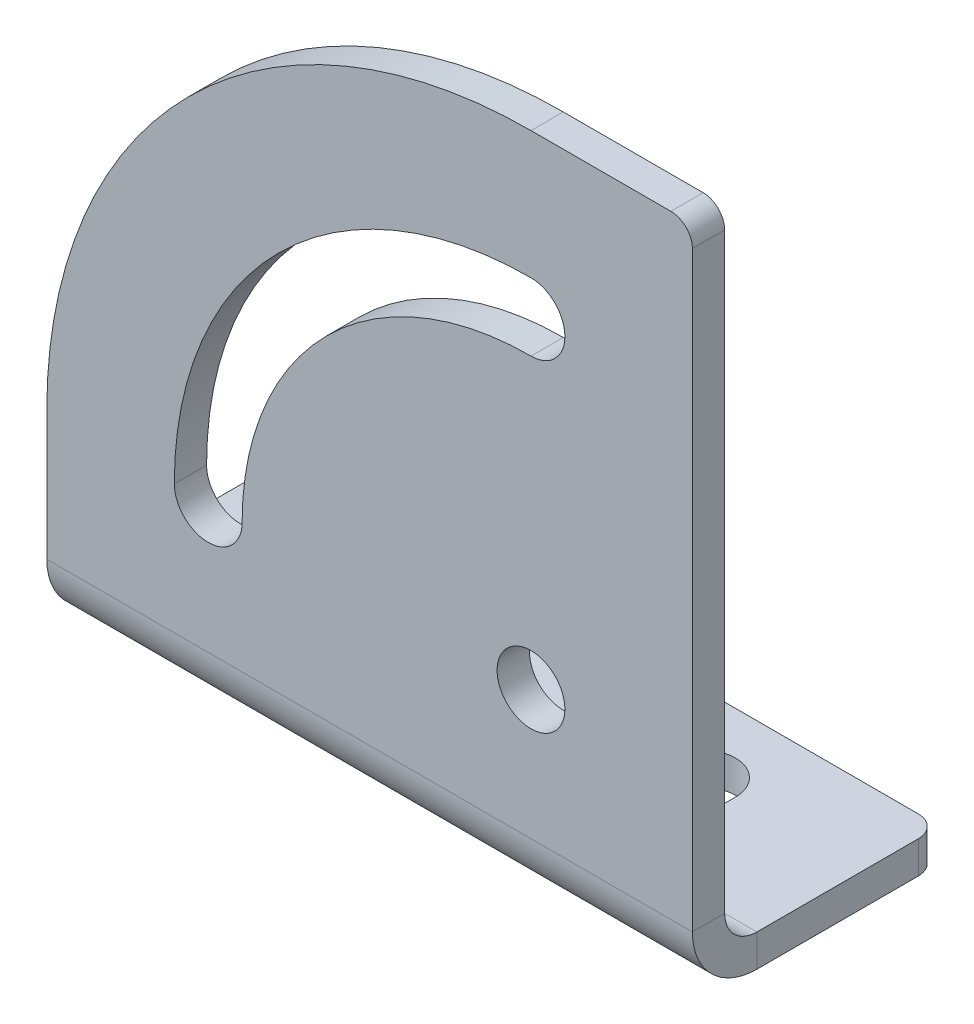
ISO-10303-21;
HEADER;
FILE_DESCRIPTION(('STEP AP214'),'2;1');
FILE_NAME('part.step','',(''),(''),'','','');
FILE_SCHEMA(('AUTOMOTIVE_DESIGN { 1 0 10303 214 1 1 1 1 }'));
ENDSEC;
DATA;
#1=APPLICATION_CONTEXT('core data for automotive mechanical design processes');
#2=APPLICATION_PROTOCOL_DEFINITION('international standard','automotive_design',2000,#1);
#3=PRODUCT_CONTEXT('',#1,'mechanical');
#4=PRODUCT('Part','Part','',(#3));
#5=PRODUCT_RELATED_PRODUCT_CATEGORY('part','',(#4));
#6=PRODUCT_DEFINITION_FORMATION('','',#4);
#7=PRODUCT_DEFINITION_CONTEXT('part definition',#1,'design');
#8=PRODUCT_DEFINITION('design','',#6,#7);
#9=PRODUCT_DEFINITION_SHAPE('','',#8);
#10=(LENGTH_UNIT() NAMED_UNIT(*) SI_UNIT(.MILLI.,.METRE.));
#11=(NAMED_UNIT(*) PLANE_ANGLE_UNIT() SI_UNIT($,.RADIAN.));
#12=(NAMED_UNIT(*) SI_UNIT($,.STERADIAN.) SOLID_ANGLE_UNIT());
#13=UNCERTAINTY_MEASURE_WITH_UNIT(LENGTH_MEASURE(1.E-05),#10,'distance_accuracy_value','');
#14=(GEOMETRIC_REPRESENTATION_CONTEXT(3) GLOBAL_UNCERTAINTY_ASSIGNED_CONTEXT((#13)) GLOBAL_UNIT_ASSIGNED_CONTEXT((#10,
#11,#12)) REPRESENTATION_CONTEXT('',''));
#15=CARTESIAN_POINT('',(0.,0.,0.));
#16=DIRECTION('',(0.,0.,1.));
#17=DIRECTION('',(1.,0.,0.));
#18=AXIS2_PLACEMENT_3D('',#15,#16,#17);
#19=CARTESIAN_POINT('',(0.,-15.,-7.15));
#20=DIRECTION('',(0.,1.,0.));
#21=DIRECTION('',(0.,0.,1.));
#22=AXIS2_PLACEMENT_3D('',#19,#20,#21);
#23=CYLINDRICAL_SURFACE('',#22,3.15);
#24=DIRECTION('',(0.,1.,0.));
#25=VECTOR('',#24,1.);
#26=CARTESIAN_POINT('',(3.15,-15.,-7.15));
#27=LINE('',#26,#25);
#28=CARTESIAN_POINT('',(3.15,-18.,-7.15));
#29=VERTEX_POINT('',#28);
#30=CARTESIAN_POINT('',(3.15,-15.,-7.15));
#31=VERTEX_POINT('',#30);
#32=EDGE_CURVE('E382',#29,#31,#27,.T.);
#33=ORIENTED_EDGE('',*,*,#32,.F.);
#34=CARTESIAN_POINT('',(0.,-18.,-7.15));
#35=DIRECTION('',(0.,1.,0.));
#36=DIRECTION('',(0.,0.,1.));
#37=AXIS2_PLACEMENT_3D('',#34,#35,#36);
#38=CIRCLE('',#37,3.15);
#39=CARTESIAN_POINT('',(-3.15,-18.,-7.15));
#40=VERTEX_POINT('',#39);
#41=EDGE_CURVE('E341',#40,#29,#38,.T.);
#42=ORIENTED_EDGE('',*,*,#41,.F.);
#43=DIRECTION('',(0.,1.,0.));
#44=VECTOR('',#43,1.);
#45=CARTESIAN_POINT('',(-3.15,-15.,-7.15));
#46=LINE('',#45,#44);
#47=CARTESIAN_POINT('',(-3.15,-15.,-7.15));
#48=VERTEX_POINT('',#47);
#49=EDGE_CURVE('E380',#40,#48,#46,.T.);
#50=ORIENTED_EDGE('',*,*,#49,.T.);
#51=CARTESIAN_POINT('',(0.,-15.,-7.15));
#52=DIRECTION('',(0.,1.,0.));
#53=DIRECTION('',(0.,0.,1.));
#54=AXIS2_PLACEMENT_3D('',#51,#52,#53);
#55=CIRCLE('',#54,3.15);
#56=EDGE_CURVE('E215',#48,#31,#55,.T.);
#57=ORIENTED_EDGE('',*,*,#56,.T.);
#58=EDGE_LOOP('',(#33,#42,#50,#57));
#59=FACE_BOUND('',#58,.T.);
#60=ADVANCED_FACE('F16',(#59),#23,.F.);
#61=CARTESIAN_POINT('',(-3.15,-15.,-12.85));
#62=DIRECTION('',(-1.,0.,0.));
#63=DIRECTION('',(0.,0.,1.));
#64=AXIS2_PLACEMENT_3D('',#61,#62,#63);
#65=PLANE('',#64);
#66=ORIENTED_EDGE('',*,*,#49,.F.);
#67=DIRECTION('',(0.,0.,1.));
#68=VECTOR('',#67,1.);
#69=CARTESIAN_POINT('',(-3.15,-18.,-20.));
#70=LINE('',#69,#68);
#71=CARTESIAN_POINT('',(-3.15,-18.,-12.85));
#72=VERTEX_POINT('',#71);
#73=EDGE_CURVE('E317',#72,#40,#70,.T.);
#74=ORIENTED_EDGE('',*,*,#73,.F.);
#75=DIRECTION('',(0.,1.,0.));
#76=VECTOR('',#75,1.);
#77=CARTESIAN_POINT('',(-3.15,-15.,-12.85));
#78=LINE('',#77,#76);
#79=CARTESIAN_POINT('',(-3.15,-15.,-12.85));
#80=VERTEX_POINT('',#79);
#81=EDGE_CURVE('E378',#72,#80,#78,.T.);
#82=ORIENTED_EDGE('',*,*,#81,.T.);
#83=DIRECTION('',(0.,0.,1.));
#84=VECTOR('',#83,1.);
#85=CARTESIAN_POINT('',(-3.15,-15.,-12.85));
#86=LINE('',#85,#84);
#87=EDGE_CURVE('E218',#80,#48,#86,.T.);
#88=ORIENTED_EDGE('',*,*,#87,.T.);
#89=EDGE_LOOP('',(#66,#74,#82,#88));
#90=FACE_BOUND('',#89,.T.);
#91=ADVANCED_FACE('F423',(#90),#65,.F.);
#92=CARTESIAN_POINT('',(0.,-15.,-12.85));
#93=DIRECTION('',(0.,1.,0.));
#94=DIRECTION('',(0.,0.,1.));
#95=AXIS2_PLACEMENT_3D('',#92,#93,#94);
#96=CYLINDRICAL_SURFACE('',#95,3.15);
#97=ORIENTED_EDGE('',*,*,#81,.F.);
#98=CARTESIAN_POINT('',(0.,-18.,-12.85));
#99=DIRECTION('',(0.,1.,0.));
#100=DIRECTION('',(0.,0.,1.));
#101=AXIS2_PLACEMENT_3D('',#98,#99,#100);
#102=CIRCLE('',#101,3.15);
#103=CARTESIAN_POINT('',(3.15,-18.,-12.85));
#104=VERTEX_POINT('',#103);
#105=EDGE_CURVE('E331',#104,#72,#102,.T.);
#106=ORIENTED_EDGE('',*,*,#105,.F.);
#107=DIRECTION('',(0.,1.,0.));
#108=VECTOR('',#107,1.);
#109=CARTESIAN_POINT('',(3.15,-15.,-12.85));
#110=LINE('',#109,#108);
#111=CARTESIAN_POINT('',(3.15,-15.,-12.85));
#112=VERTEX_POINT('',#111);
#113=EDGE_CURVE('E376',#104,#112,#110,.T.);
#114=ORIENTED_EDGE('',*,*,#113,.T.);
#115=CARTESIAN_POINT('',(0.,-15.,-12.85));
#116=DIRECTION('',(0.,1.,0.));
#117=DIRECTION('',(0.,0.,1.));
#118=AXIS2_PLACEMENT_3D('',#115,#116,#117);
#119=CIRCLE('',#118,3.15);
#120=EDGE_CURVE('E209',#112,#80,#119,.T.);
#121=ORIENTED_EDGE('',*,*,#120,.T.);
#122=EDGE_LOOP('',(#97,#106,#114,#121));
#123=FACE_BOUND('',#122,.T.);
#124=ADVANCED_FACE('F429',(#123),#96,.F.);
#125=CARTESIAN_POINT('',(-30.,-15.,-7.15));
#126=DIRECTION('',(0.,1.,0.));
#127=DIRECTION('',(0.,0.,1.));
#128=AXIS2_PLACEMENT_3D('',#125,#126,#127);
#129=CYLINDRICAL_SURFACE('',#128,3.15);
#130=DIRECTION('',(0.,1.,0.));
#131=VECTOR('',#130,1.);
#132=CARTESIAN_POINT('',(-26.85,-15.,-7.15));
#133=LINE('',#132,#131);
#134=CARTESIAN_POINT('',(-26.85,-18.,-7.15));
#135=VERTEX_POINT('',#134);
#136=CARTESIAN_POINT('',(-26.85,-15.,-7.15));
#137=VERTEX_POINT('',#136);
#138=EDGE_CURVE('E203',#135,#137,#133,.T.);
#139=ORIENTED_EDGE('',*,*,#138,.F.);
#140=CARTESIAN_POINT('',(-30.,-18.,-7.15));
#141=DIRECTION('',(0.,1.,0.));
#142=DIRECTION('',(0.,0.,1.));
#143=AXIS2_PLACEMENT_3D('',#140,#141,#142);
#144=CIRCLE('',#143,3.15);
#145=CARTESIAN_POINT('',(-33.15,-18.,-7.15));
#146=VERTEX_POINT('',#145);
#147=EDGE_CURVE('E332',#146,#135,#144,.T.);
#148=ORIENTED_EDGE('',*,*,#147,.F.);
#149=DIRECTION('',(0.,1.,0.));
#150=VECTOR('',#149,1.);
#151=CARTESIAN_POINT('',(-33.15,-15.,-7.15));
#152=LINE('',#151,#150);
#153=CARTESIAN_POINT('',(-33.15,-15.,-7.15));
#154=VERTEX_POINT('',#153);
#155=EDGE_CURVE('E374',#146,#154,#152,.T.);
#156=ORIENTED_EDGE('',*,*,#155,.T.);
#157=CARTESIAN_POINT('',(-30.,-15.,-7.15));
#158=DIRECTION('',(0.,1.,0.));
#159=DIRECTION('',(0.,0.,1.));
#160=AXIS2_PLACEMENT_3D('',#157,#158,#159);
#161=CIRCLE('',#160,3.15);
#162=EDGE_CURVE('E204',#154,#137,#161,.T.);
#163=ORIENTED_EDGE('',*,*,#162,.T.);
#164=EDGE_LOOP('',(#139,#148,#156,#163));
#165=FACE_BOUND('',#164,.T.);
#166=ADVANCED_FACE('F515',(#165),#129,.F.);
#167=CARTESIAN_POINT('',(-33.15,-15.,-12.85));
#168=DIRECTION('',(-1.,0.,0.));
#169=DIRECTION('',(0.,0.,1.));
#170=AXIS2_PLACEMENT_3D('',#167,#168,#169);
#171=PLANE('',#170);
#172=ORIENTED_EDGE('',*,*,#155,.F.);
#173=DIRECTION('',(0.,0.,1.));
#174=VECTOR('',#173,1.);
#175=CARTESIAN_POINT('',(-33.15,-18.,-20.));
#176=LINE('',#175,#174);
#177=CARTESIAN_POINT('',(-33.15,-18.,-12.85));
#178=VERTEX_POINT('',#177);
#179=EDGE_CURVE('E328',#178,#146,#176,.T.);
#180=ORIENTED_EDGE('',*,*,#179,.F.);
#181=DIRECTION('',(0.,1.,0.));
#182=VECTOR('',#181,1.);
#183=CARTESIAN_POINT('',(-33.15,-15.,-12.85));
#184=LINE('',#183,#182);
#185=CARTESIAN_POINT('',(-33.15,-15.,-12.85));
#186=VERTEX_POINT('',#185);
#187=EDGE_CURVE('E188',#178,#186,#184,.T.);
#188=ORIENTED_EDGE('',*,*,#187,.T.);
#189=DIRECTION('',(0.,0.,1.));
#190=VECTOR('',#189,1.);
#191=CARTESIAN_POINT('',(-33.15,-15.,-12.85));
#192=LINE('',#191,#190);
#193=EDGE_CURVE('E199',#186,#154,#192,.T.);
#194=ORIENTED_EDGE('',*,*,#193,.T.);
#195=EDGE_LOOP('',(#172,#180,#188,#194));
#196=FACE_BOUND('',#195,.T.);
#197=ADVANCED_FACE('F512',(#196),#171,.F.);
#198=CARTESIAN_POINT('',(-30.,-15.,-12.85));
#199=DIRECTION('',(0.,1.,0.));
#200=DIRECTION('',(0.,0.,1.));
#201=AXIS2_PLACEMENT_3D('',#198,#199,#200);
#202=CYLINDRICAL_SURFACE('',#201,3.15);
#203=ORIENTED_EDGE('',*,*,#187,.F.);
#204=CARTESIAN_POINT('',(-30.,-18.,-12.85));
#205=DIRECTION('',(0.,1.,0.));
#206=DIRECTION('',(0.,0.,1.));
#207=AXIS2_PLACEMENT_3D('',#204,#205,#206);
#208=CIRCLE('',#207,3.15);
#209=CARTESIAN_POINT('',(-26.85,-18.,-12.85));
#210=VERTEX_POINT('',#209);
#211=EDGE_CURVE('E183',#210,#178,#208,.T.);
#212=ORIENTED_EDGE('',*,*,#211,.F.);
#213=DIRECTION('',(0.,1.,0.));
#214=VECTOR('',#213,1.);
#215=CARTESIAN_POINT('',(-26.85,-15.,-12.85));
#216=LINE('',#215,#214);
#217=CARTESIAN_POINT('',(-26.85,-15.,-12.85));
#218=VERTEX_POINT('',#217);
#219=EDGE_CURVE('E177',#210,#218,#216,.T.);
#220=ORIENTED_EDGE('',*,*,#219,.T.);
#221=CARTESIAN_POINT('',(-30.,-15.,-12.85));
#222=DIRECTION('',(0.,1.,0.));
#223=DIRECTION('',(0.,0.,1.));
#224=AXIS2_PLACEMENT_3D('',#221,#222,#223);
#225=CIRCLE('',#224,3.15);
#226=EDGE_CURVE('E180',#218,#186,#225,.T.);
#227=ORIENTED_EDGE('',*,*,#226,.T.);
#228=EDGE_LOOP('',(#203,#212,#220,#227));
#229=FACE_BOUND('',#228,.T.);
#230=ADVANCED_FACE('F179',(#229),#202,.F.);
#231=CARTESIAN_POINT('',(15.,-15.,-20.));
#232=DIRECTION('',(-1.,0.,0.));
#233=DIRECTION('',(0.,0.,1.));
#234=AXIS2_PLACEMENT_3D('',#231,#232,#233);
#235=PLANE('',#234);
#236=DIRECTION('',(0.,1.,0.));
#237=VECTOR('',#236,1.);
#238=CARTESIAN_POINT('',(15.,-15.,-3.));
#239=LINE('',#238,#237);
#240=CARTESIAN_POINT('',(15.,-18.,-3.));
#241=VERTEX_POINT('',#240);
#242=CARTESIAN_POINT('',(15.,-15.,-3.));
#243=VERTEX_POINT('',#242);
#244=EDGE_CURVE('E189',#241,#243,#239,.T.);
#245=ORIENTED_EDGE('',*,*,#244,.F.);
#246=DIRECTION('',(0.,0.,1.));
#247=VECTOR('',#246,1.);
#248=CARTESIAN_POINT('',(15.,-18.,-20.));
#249=LINE('',#248,#247);
#250=CARTESIAN_POINT('',(15.,-18.,-18.));
#251=VERTEX_POINT('',#250);
#252=EDGE_CURVE('E310',#251,#241,#249,.T.);
#253=ORIENTED_EDGE('',*,*,#252,.F.);
#254=DIRECTION('',(0.,1.,0.));
#255=VECTOR('',#254,1.);
#256=CARTESIAN_POINT('',(15.,-15.,-18.));
#257=LINE('',#256,#255);
#258=CARTESIAN_POINT('',(15.,-15.,-18.));
#259=VERTEX_POINT('',#258);
#260=EDGE_CURVE('E369',#251,#259,#257,.T.);
#261=ORIENTED_EDGE('',*,*,#260,.T.);
#262=DIRECTION('',(0.,0.,1.));
#263=VECTOR('',#262,1.);
#264=CARTESIAN_POINT('',(15.,-15.,-20.));
#265=LINE('',#264,#263);
#266=EDGE_CURVE('E230',#259,#243,#265,.T.);
#267=ORIENTED_EDGE('',*,*,#266,.T.);
#268=EDGE_LOOP('',(#245,#253,#261,#267));
#269=FACE_BOUND('',#268,.T.);
#270=ADVANCED_FACE('F473',(#269),#235,.F.);
#271=CARTESIAN_POINT('',(13.,-15.,-18.));
#272=DIRECTION('',(0.,1.,0.));
#273=DIRECTION('',(0.,0.,1.));
#274=AXIS2_PLACEMENT_3D('',#271,#272,#273);
#275=CYLINDRICAL_SURFACE('',#274,2.);
#276=ORIENTED_EDGE('',*,*,#260,.F.);
#277=CARTESIAN_POINT('',(13.,-18.,-18.));
#278=DIRECTION('',(0.,1.,0.));
#279=DIRECTION('',(0.,0.,1.));
#280=AXIS2_PLACEMENT_3D('',#277,#278,#279);
#281=CIRCLE('',#280,2.);
#282=CARTESIAN_POINT('',(13.,-18.,-20.));
#283=VERTEX_POINT('',#282);
#284=EDGE_CURVE('E284',#251,#283,#281,.T.);
#285=ORIENTED_EDGE('',*,*,#284,.T.);
#286=DIRECTION('',(0.,1.,0.));
#287=VECTOR('',#286,1.);
#288=CARTESIAN_POINT('',(13.,-15.,-20.));
#289=LINE('',#288,#287);
#290=CARTESIAN_POINT('',(13.,-15.,-20.));
#291=VERTEX_POINT('',#290);
#292=EDGE_CURVE('E367',#283,#291,#289,.T.);
#293=ORIENTED_EDGE('',*,*,#292,.T.);
#294=CARTESIAN_POINT('',(13.,-15.,-18.));
#295=DIRECTION('',(0.,1.,0.));
#296=DIRECTION('',(0.,0.,1.));
#297=AXIS2_PLACEMENT_3D('',#294,#295,#296);
#298=CIRCLE('',#297,2.);
#299=EDGE_CURVE('E233',#259,#291,#298,.T.);
#300=ORIENTED_EDGE('',*,*,#299,.F.);
#301=EDGE_LOOP('',(#276,#285,#293,#300));
#302=FACE_BOUND('',#301,.T.);
#303=ADVANCED_FACE('F478',(#302),#275,.T.);
#304=CARTESIAN_POINT('',(0.,-15.,-20.));
#305=DIRECTION('',(0.,0.,-1.));
#306=DIRECTION('',(-1.,0.,0.));
#307=AXIS2_PLACEMENT_3D('',#304,#305,#306);
#308=PLANE('',#307);
#309=ORIENTED_EDGE('',*,*,#292,.F.);
#310=DIRECTION('',(1.,0.,0.));
#311=VECTOR('',#310,1.);
#312=CARTESIAN_POINT('',(0.,-18.,-20.));
#313=LINE('',#312,#311);
#314=CARTESIAN_POINT('',(-43.,-18.,-20.));
#315=VERTEX_POINT('',#314);
#316=EDGE_CURVE('E314',#283,#315,#313,.F.);
#317=ORIENTED_EDGE('',*,*,#316,.T.);
#318=DIRECTION('',(0.,1.,0.));
#319=VECTOR('',#318,1.);
#320=CARTESIAN_POINT('',(-43.,-15.,-20.));
#321=LINE('',#320,#319);
#322=CARTESIAN_POINT('',(-43.,-15.,-20.));
#323=VERTEX_POINT('',#322);
#324=EDGE_CURVE('E365',#315,#323,#321,.T.);
#325=ORIENTED_EDGE('',*,*,#324,.T.);
#326=DIRECTION('',(-1.,0.,0.));
#327=VECTOR('',#326,1.);
#328=CARTESIAN_POINT('',(0.,-15.,-20.));
#329=LINE('',#328,#327);
#330=EDGE_CURVE('E221',#291,#323,#329,.T.);
#331=ORIENTED_EDGE('',*,*,#330,.F.);
#332=EDGE_LOOP('',(#309,#317,#325,#331));
#333=FACE_BOUND('',#332,.T.);
#334=ADVANCED_FACE('F482',(#333),#308,.T.);
#335=CARTESIAN_POINT('',(-43.,-15.,-18.));
#336=DIRECTION('',(0.,1.,0.));
#337=DIRECTION('',(0.,0.,1.));
#338=AXIS2_PLACEMENT_3D('',#335,#336,#337);
#339=CYLINDRICAL_SURFACE('',#338,2.);
#340=ORIENTED_EDGE('',*,*,#324,.F.);
#341=CARTESIAN_POINT('',(-43.,-18.,-18.));
#342=DIRECTION('',(0.,1.,0.));
#343=DIRECTION('',(0.,0.,1.));
#344=AXIS2_PLACEMENT_3D('',#341,#342,#343);
#345=CIRCLE('',#344,2.);
#346=CARTESIAN_POINT('',(-45.,-18.,-18.));
#347=VERTEX_POINT('',#346);
#348=EDGE_CURVE('E311',#315,#347,#345,.T.);
#349=ORIENTED_EDGE('',*,*,#348,.T.);
#350=DIRECTION('',(0.,1.,0.));
#351=VECTOR('',#350,1.);
#352=CARTESIAN_POINT('',(-45.,-15.,-18.));
#353=LINE('',#352,#351);
#354=CARTESIAN_POINT('',(-45.,-15.,-18.));
#355=VERTEX_POINT('',#354);
#356=EDGE_CURVE('E363',#347,#355,#353,.T.);
#357=ORIENTED_EDGE('',*,*,#356,.T.);
#358=CARTESIAN_POINT('',(-43.,-15.,-18.));
#359=DIRECTION('',(0.,1.,0.));
#360=DIRECTION('',(0.,0.,1.));
#361=AXIS2_PLACEMENT_3D('',#358,#359,#360);
#362=CIRCLE('',#361,2.);
#363=EDGE_CURVE('E224',#323,#355,#362,.T.);
#364=ORIENTED_EDGE('',*,*,#363,.F.);
#365=EDGE_LOOP('',(#340,#349,#357,#364));
#366=FACE_BOUND('',#365,.T.);
#367=ADVANCED_FACE('F486',(#366),#339,.T.);
#368=CARTESIAN_POINT('',(-45.,-15.,-20.));
#369=DIRECTION('',(-1.,0.,0.));
#370=DIRECTION('',(0.,0.,1.));
#371=AXIS2_PLACEMENT_3D('',#368,#369,#370);
#372=PLANE('',#371);
#373=ORIENTED_EDGE('',*,*,#356,.F.);
#374=DIRECTION('',(0.,0.,1.));
#375=VECTOR('',#374,1.);
#376=CARTESIAN_POINT('',(-45.,-18.,-20.));
#377=LINE('',#376,#375);
#378=CARTESIAN_POINT('',(-45.,-18.,-3.));
#379=VERTEX_POINT('',#378);
#380=EDGE_CURVE('E307',#347,#379,#377,.T.);
#381=ORIENTED_EDGE('',*,*,#380,.T.);
#382=DIRECTION('',(0.,1.,0.));
#383=VECTOR('',#382,1.);
#384=CARTESIAN_POINT('',(-45.,-15.,-3.));
#385=LINE('',#384,#383);
#386=CARTESIAN_POINT('',(-45.,-15.,-3.));
#387=VERTEX_POINT('',#386);
#388=EDGE_CURVE('E361',#379,#387,#385,.T.);
#389=ORIENTED_EDGE('',*,*,#388,.T.);
#390=DIRECTION('',(0.,0.,1.));
#391=VECTOR('',#390,1.);
#392=CARTESIAN_POINT('',(-45.,-15.,-20.));
#393=LINE('',#392,#391);
#394=EDGE_CURVE('E227',#355,#387,#393,.T.);
#395=ORIENTED_EDGE('',*,*,#394,.F.);
#396=EDGE_LOOP('',(#373,#381,#389,#395));
#397=FACE_BOUND('',#396,.T.);
#398=ADVANCED_FACE('F487',(#397),#372,.T.);
#399=CARTESIAN_POINT('',(-45.,-12.,-3.));
#400=DIRECTION('',(1.,0.,0.));
#401=DIRECTION('',(0.,0.,-1.));
#402=AXIS2_PLACEMENT_3D('',#399,#400,#401);
#403=PLANE('',#402);
#404=ORIENTED_EDGE('',*,*,#388,.F.);
#405=CARTESIAN_POINT('',(-45.,-12.,-3.));
#406=DIRECTION('',(-1.,0.,0.));
#407=DIRECTION('',(0.,0.,1.));
#408=AXIS2_PLACEMENT_3D('',#405,#406,#407);
#409=CIRCLE('',#408,6.);
#410=CARTESIAN_POINT('',(-45.,-12.,3.));
#411=VERTEX_POINT('',#410);
#412=EDGE_CURVE('E303',#379,#411,#409,.T.);
#413=ORIENTED_EDGE('',*,*,#412,.T.);
#414=DIRECTION('',(0.,0.,-1.));
#415=VECTOR('',#414,1.);
#416=CARTESIAN_POINT('',(-45.,-12.,0.));
#417=LINE('',#416,#415);
#418=CARTESIAN_POINT('',(-45.,-12.,0.));
#419=VERTEX_POINT('',#418);
#420=EDGE_CURVE('E359',#411,#419,#417,.T.);
#421=ORIENTED_EDGE('',*,*,#420,.T.);
#422=CARTESIAN_POINT('',(-45.,-12.,-3.));
#423=DIRECTION('',(-1.,0.,0.));
#424=DIRECTION('',(0.,0.,1.));
#425=AXIS2_PLACEMENT_3D('',#422,#423,#424);
#426=CIRCLE('',#425,3.);
#427=EDGE_CURVE('E200',#387,#419,#426,.T.);
#428=ORIENTED_EDGE('',*,*,#427,.F.);
#429=EDGE_LOOP('',(#404,#413,#421,#428));
#430=FACE_BOUND('',#429,.T.);
#431=ADVANCED_FACE('F466',(#430),#403,.F.);
#432=CARTESIAN_POINT('',(-45.,-15.,0.));
#433=DIRECTION('',(1.,0.,0.));
#434=DIRECTION('',(0.,-1.,0.));
#435=AXIS2_PLACEMENT_3D('',#432,#433,#434);
#436=PLANE('',#435);
#437=ORIENTED_EDGE('',*,*,#420,.F.);
#438=DIRECTION('',(0.,1.,0.));
#439=VECTOR('',#438,1.);
#440=CARTESIAN_POINT('',(-45.,0.,3.));
#441=LINE('',#440,#439);
#442=CARTESIAN_POINT('',(-45.,0.,3.));
#443=VERTEX_POINT('',#442);
#444=EDGE_CURVE('E288',#443,#411,#441,.F.);
#445=ORIENTED_EDGE('',*,*,#444,.F.);
#446=DIRECTION('',(0.,0.,-1.));
#447=VECTOR('',#446,1.);
#448=CARTESIAN_POINT('',(-45.,0.,0.));
#449=LINE('',#448,#447);
#450=CARTESIAN_POINT('',(-45.,0.,0.));
#451=VERTEX_POINT('',#450);
#452=EDGE_CURVE('E357',#443,#451,#449,.T.);
#453=ORIENTED_EDGE('',*,*,#452,.T.);
#454=DIRECTION('',(0.,-1.,0.));
#455=VECTOR('',#454,1.);
#456=CARTESIAN_POINT('',(-45.,-15.,0.));
#457=LINE('',#456,#455);
#458=EDGE_CURVE('E248',#451,#419,#457,.T.);
#459=ORIENTED_EDGE('',*,*,#458,.T.);
#460=EDGE_LOOP('',(#437,#445,#453,#459));
#461=FACE_BOUND('',#460,.T.);
#462=ADVANCED_FACE('F408',(#461),#436,.F.);
#463=CARTESIAN_POINT('',(0.,0.,0.));
#464=DIRECTION('',(0.,0.,-1.));
#465=DIRECTION('',(-1.,0.,0.));
#466=AXIS2_PLACEMENT_3D('',#463,#464,#465);
#467=CYLINDRICAL_SURFACE('',#466,45.);
#468=ORIENTED_EDGE('',*,*,#452,.F.);
#469=CARTESIAN_POINT('',(0.,0.,3.));
#470=DIRECTION('',(0.,0.,1.));
#471=DIRECTION('',(1.,0.,0.));
#472=AXIS2_PLACEMENT_3D('',#469,#470,#471);
#473=CIRCLE('',#472,45.);
#474=CARTESIAN_POINT('',(1.98625837999344E-13,45.,3.));
#475=VERTEX_POINT('',#474);
#476=EDGE_CURVE('E298',#475,#443,#473,.T.);
#477=ORIENTED_EDGE('',*,*,#476,.F.);
#478=DIRECTION('',(0.,0.,-1.));
#479=VECTOR('',#478,1.);
#480=CARTESIAN_POINT('',(1.98625837999344E-13,45.,0.));
#481=LINE('',#480,#479);
#482=CARTESIAN_POINT('',(1.98625837999344E-13,45.,0.));
#483=VERTEX_POINT('',#482);
#484=EDGE_CURVE('E354',#475,#483,#481,.T.);
#485=ORIENTED_EDGE('',*,*,#484,.T.);
#486=CARTESIAN_POINT('',(0.,0.,0.));
#487=DIRECTION('',(0.,0.,1.));
#488=DIRECTION('',(-1.,0.,0.));
#489=AXIS2_PLACEMENT_3D('',#486,#487,#488);
#490=CIRCLE('',#489,45.);
#491=EDGE_CURVE('E251',#483,#451,#490,.T.);
#492=ORIENTED_EDGE('',*,*,#491,.T.);
#493=EDGE_LOOP('',(#468,#477,#485,#492));
#494=FACE_BOUND('',#493,.T.);
#495=ADVANCED_FACE('F400',(#494),#467,.T.);
#496=CARTESIAN_POINT('',(15.,45.,0.));
#497=DIRECTION('',(0.,-1.,0.));
#498=DIRECTION('',(-1.,0.,0.));
#499=AXIS2_PLACEMENT_3D('',#496,#497,#498);
#500=PLANE('',#499);
#501=DIRECTION('',(-1.,0.,0.));
#502=VECTOR('',#501,1.);
#503=CARTESIAN_POINT('',(0.,45.,3.));
#504=LINE('',#503,#502);
#505=CARTESIAN_POINT('',(13.,45.,3.));
#506=VERTEX_POINT('',#505);
#507=EDGE_CURVE('E296',#506,#475,#504,.T.);
#508=ORIENTED_EDGE('',*,*,#507,.F.);
#509=DIRECTION('',(0.,0.,1.));
#510=VECTOR('',#509,1.);
#511=CARTESIAN_POINT('',(13.,45.,0.));
#512=LINE('',#511,#510);
#513=CARTESIAN_POINT('',(13.,45.,0.));
#514=VERTEX_POINT('',#513);
#515=EDGE_CURVE('E384',#506,#514,#512,.F.);
#516=ORIENTED_EDGE('',*,*,#515,.T.);
#517=DIRECTION('',(-1.,0.,0.));
#518=VECTOR('',#517,1.);
#519=CARTESIAN_POINT('',(15.,45.,0.));
#520=LINE('',#519,#518);
#521=EDGE_CURVE('E254',#514,#483,#520,.T.);
#522=ORIENTED_EDGE('',*,*,#521,.T.);
#523=ORIENTED_EDGE('',*,*,#484,.F.);
#524=EDGE_LOOP('',(#508,#516,#522,#523));
#525=FACE_BOUND('',#524,.T.);
#526=ADVANCED_FACE('F391',(#525),#500,.F.);
#527=CARTESIAN_POINT('',(15.,-15.,0.));
#528=DIRECTION('',(-1.,0.,0.));
#529=DIRECTION('',(0.,1.,0.));
#530=AXIS2_PLACEMENT_3D('',#527,#528,#529);
#531=PLANE('',#530);
#532=DIRECTION('',(0.,1.,0.));
#533=VECTOR('',#532,1.);
#534=CARTESIAN_POINT('',(15.,-15.,0.));
#535=LINE('',#534,#533);
#536=CARTESIAN_POINT('',(15.,-12.,0.));
#537=VERTEX_POINT('',#536);
#538=CARTESIAN_POINT('',(15.,43.,0.));
#539=VERTEX_POINT('',#538);
#540=EDGE_CURVE('E256',#537,#539,#535,.T.);
#541=ORIENTED_EDGE('',*,*,#540,.T.);
#542=DIRECTION('',(0.,0.,1.));
#543=VECTOR('',#542,1.);
#544=CARTESIAN_POINT('',(15.,43.,0.));
#545=LINE('',#544,#543);
#546=CARTESIAN_POINT('',(15.,43.,3.));
#547=VERTEX_POINT('',#546);
#548=EDGE_CURVE('E24',#539,#547,#545,.T.);
#549=ORIENTED_EDGE('',*,*,#548,.T.);
#550=DIRECTION('',(0.,1.,0.));
#551=VECTOR('',#550,1.);
#552=CARTESIAN_POINT('',(15.,0.,3.));
#553=LINE('',#552,#551);
#554=CARTESIAN_POINT('',(15.,-12.,3.));
#555=VERTEX_POINT('',#554);
#556=EDGE_CURVE('E294',#555,#547,#553,.T.);
#557=ORIENTED_EDGE('',*,*,#556,.F.);
#558=DIRECTION('',(0.,0.,-1.));
#559=VECTOR('',#558,1.);
#560=CARTESIAN_POINT('',(15.,-12.,0.));
#561=LINE('',#560,#559);
#562=EDGE_CURVE('E352',#555,#537,#561,.T.);
#563=ORIENTED_EDGE('',*,*,#562,.T.);
#564=EDGE_LOOP('',(#541,#549,#557,#563));
#565=FACE_BOUND('',#564,.T.);
#566=ADVANCED_FACE('F601',(#565),#531,.F.);
#567=CARTESIAN_POINT('',(0.,0.,0.));
#568=DIRECTION('',(0.,0.,-1.));
#569=DIRECTION('',(-1.,0.,0.));
#570=AXIS2_PLACEMENT_3D('',#567,#568,#569);
#571=CYLINDRICAL_SURFACE('',#570,33.15);
#572=DIRECTION('',(0.,0.,-1.));
#573=VECTOR('',#572,1.);
#574=CARTESIAN_POINT('',(0.,33.15,0.));
#575=LINE('',#574,#573);
#576=CARTESIAN_POINT('',(0.,33.15,3.));
#577=VERTEX_POINT('',#576);
#578=CARTESIAN_POINT('',(0.,33.15,0.));
#579=VERTEX_POINT('',#578);
#580=EDGE_CURVE('E350',#577,#579,#575,.T.);
#581=ORIENTED_EDGE('',*,*,#580,.F.);
#582=CARTESIAN_POINT('',(0.,0.,3.));
#583=DIRECTION('',(0.,0.,1.));
#584=DIRECTION('',(1.,0.,0.));
#585=AXIS2_PLACEMENT_3D('',#582,#583,#584);
#586=CIRCLE('',#585,33.15);
#587=CARTESIAN_POINT('',(-33.15,0.,3.));
#588=VERTEX_POINT('',#587);
#589=EDGE_CURVE('E289',#577,#588,#586,.T.);
#590=ORIENTED_EDGE('',*,*,#589,.T.);
#591=DIRECTION('',(0.,0.,-1.));
#592=VECTOR('',#591,1.);
#593=CARTESIAN_POINT('',(-33.15,0.,0.));
#594=LINE('',#593,#592);
#595=CARTESIAN_POINT('',(-33.15,0.,0.));
#596=VERTEX_POINT('',#595);
#597=EDGE_CURVE('E348',#588,#596,#594,.T.);
#598=ORIENTED_EDGE('',*,*,#597,.T.);
#599=CARTESIAN_POINT('',(0.,0.,0.));
#600=DIRECTION('',(0.,0.,1.));
#601=DIRECTION('',(1.,0.,0.));
#602=AXIS2_PLACEMENT_3D('',#599,#600,#601);
#603=CIRCLE('',#602,33.15);
#604=EDGE_CURVE('E242',#579,#596,#603,.T.);
#605=ORIENTED_EDGE('',*,*,#604,.F.);
#606=EDGE_LOOP('',(#581,#590,#598,#605));
#607=FACE_BOUND('',#606,.T.);
#608=ADVANCED_FACE('F611',(#607),#571,.F.);
#609=CARTESIAN_POINT('',(-30.,0.,0.));
#610=DIRECTION('',(0.,0.,-1.));
#611=DIRECTION('',(-1.,0.,0.));
#612=AXIS2_PLACEMENT_3D('',#609,#610,#611);
#613=CYLINDRICAL_SURFACE('',#612,3.15);
#614=ORIENTED_EDGE('',*,*,#597,.F.);
#615=CARTESIAN_POINT('',(-30.,0.,3.));
#616=DIRECTION('',(0.,0.,1.));
#617=DIRECTION('',(1.,0.,0.));
#618=AXIS2_PLACEMENT_3D('',#615,#616,#617);
#619=CIRCLE('',#618,3.15);
#620=CARTESIAN_POINT('',(-26.85,0.,3.));
#621=VERTEX_POINT('',#620);
#622=EDGE_CURVE('E285',#588,#621,#619,.T.);
#623=ORIENTED_EDGE('',*,*,#622,.T.);
#624=DIRECTION('',(0.,0.,-1.));
#625=VECTOR('',#624,1.);
#626=CARTESIAN_POINT('',(-26.85,0.,0.));
#627=LINE('',#626,#625);
#628=CARTESIAN_POINT('',(-26.85,0.,0.));
#629=VERTEX_POINT('',#628);
#630=EDGE_CURVE('E346',#621,#629,#627,.T.);
#631=ORIENTED_EDGE('',*,*,#630,.T.);
#632=CARTESIAN_POINT('',(-30.,0.,0.));
#633=DIRECTION('',(0.,0.,1.));
#634=DIRECTION('',(1.,0.,0.));
#635=AXIS2_PLACEMENT_3D('',#632,#633,#634);
#636=CIRCLE('',#635,3.15);
#637=EDGE_CURVE('E245',#596,#629,#636,.T.);
#638=ORIENTED_EDGE('',*,*,#637,.F.);
#639=EDGE_LOOP('',(#614,#623,#631,#638));
#640=FACE_BOUND('',#639,.T.);
#641=ADVANCED_FACE('F620',(#640),#613,.F.);
#642=CARTESIAN_POINT('',(0.,0.,0.));
#643=DIRECTION('',(0.,0.,-1.));
#644=DIRECTION('',(-1.,0.,0.));
#645=AXIS2_PLACEMENT_3D('',#642,#643,#644);
#646=CYLINDRICAL_SURFACE('',#645,26.85);
#647=ORIENTED_EDGE('',*,*,#630,.F.);
#648=CARTESIAN_POINT('',(0.,0.,3.));
#649=DIRECTION('',(0.,0.,-1.));
#650=DIRECTION('',(-1.,0.,0.));
#651=AXIS2_PLACEMENT_3D('',#648,#649,#650);
#652=CIRCLE('',#651,26.85);
#653=CARTESIAN_POINT('',(0.,26.85,3.));
#654=VERTEX_POINT('',#653);
#655=EDGE_CURVE('E280',#621,#654,#652,.T.);
#656=ORIENTED_EDGE('',*,*,#655,.T.);
#657=DIRECTION('',(0.,0.,-1.));
#658=VECTOR('',#657,1.);
#659=CARTESIAN_POINT('',(0.,26.85,0.));
#660=LINE('',#659,#658);
#661=CARTESIAN_POINT('',(0.,26.85,0.));
#662=VERTEX_POINT('',#661);
#663=EDGE_CURVE('E267',#654,#662,#660,.T.);
#664=ORIENTED_EDGE('',*,*,#663,.T.);
#665=CARTESIAN_POINT('',(0.,0.,0.));
#666=DIRECTION('',(0.,0.,-1.));
#667=DIRECTION('',(1.,0.,0.));
#668=AXIS2_PLACEMENT_3D('',#665,#666,#667);
#669=CIRCLE('',#668,26.85);
#670=EDGE_CURVE('E236',#629,#662,#669,.T.);
#671=ORIENTED_EDGE('',*,*,#670,.F.);
#672=EDGE_LOOP('',(#647,#656,#664,#671));
#673=FACE_BOUND('',#672,.T.);
#674=ADVANCED_FACE('F444',(#673),#646,.T.);
#675=CARTESIAN_POINT('',(-26.85,-15.,-12.85));
#676=DIRECTION('',(1.,0.,0.));
#677=DIRECTION('',(0.,0.,-1.));
#678=AXIS2_PLACEMENT_3D('',#675,#676,#677);
#679=PLANE('',#678);
#680=DIRECTION('',(0.,0.,1.));
#681=VECTOR('',#680,1.);
#682=CARTESIAN_POINT('',(-26.85,-18.,-20.));
#683=LINE('',#682,#681);
#684=EDGE_CURVE('E327',#135,#210,#683,.F.);
#685=ORIENTED_EDGE('',*,*,#684,.F.);
#686=ORIENTED_EDGE('',*,*,#138,.T.);
#687=DIRECTION('',(0.,0.,-1.));
#688=VECTOR('',#687,1.);
#689=CARTESIAN_POINT('',(-26.85,-15.,-12.85));
#690=LINE('',#689,#688);
#691=EDGE_CURVE('E196',#137,#218,#690,.T.);
#692=ORIENTED_EDGE('',*,*,#691,.T.);
#693=ORIENTED_EDGE('',*,*,#219,.F.);
#694=EDGE_LOOP('',(#685,#686,#692,#693));
#695=FACE_BOUND('',#694,.T.);
#696=ADVANCED_FACE('F202',(#695),#679,.F.);
#697=CARTESIAN_POINT('',(3.15,-15.,-12.85));
#698=DIRECTION('',(1.,0.,0.));
#699=DIRECTION('',(0.,0.,-1.));
#700=AXIS2_PLACEMENT_3D('',#697,#698,#699);
#701=PLANE('',#700);
#702=DIRECTION('',(0.,0.,1.));
#703=VECTOR('',#702,1.);
#704=CARTESIAN_POINT('',(3.15,-18.,-20.));
#705=LINE('',#704,#703);
#706=EDGE_CURVE('E338',#29,#104,#705,.F.);
#707=ORIENTED_EDGE('',*,*,#706,.F.);
#708=ORIENTED_EDGE('',*,*,#32,.T.);
#709=DIRECTION('',(0.,0.,-1.));
#710=VECTOR('',#709,1.);
#711=CARTESIAN_POINT('',(3.15,-15.,-12.85));
#712=LINE('',#711,#710);
#713=EDGE_CURVE('E212',#31,#112,#712,.T.);
#714=ORIENTED_EDGE('',*,*,#713,.T.);
#715=ORIENTED_EDGE('',*,*,#113,.F.);
#716=EDGE_LOOP('',(#707,#708,#714,#715));
#717=FACE_BOUND('',#716,.T.);
#718=ADVANCED_FACE('F433',(#717),#701,.F.);
#719=CARTESIAN_POINT('',(0.,30.,0.));
#720=DIRECTION('',(0.,0.,-1.));
#721=DIRECTION('',(-1.,0.,0.));
#722=AXIS2_PLACEMENT_3D('',#719,#720,#721);
#723=CYLINDRICAL_SURFACE('',#722,3.15);
#724=CARTESIAN_POINT('',(0.,30.,3.));
#725=DIRECTION('',(0.,0.,1.));
#726=DIRECTION('',(1.,0.,0.));
#727=AXIS2_PLACEMENT_3D('',#724,#725,#726);
#728=CIRCLE('',#727,3.15);
#729=EDGE_CURVE('E283',#654,#577,#728,.T.);
#730=ORIENTED_EDGE('',*,*,#729,.T.);
#731=ORIENTED_EDGE('',*,*,#580,.T.);
#732=CARTESIAN_POINT('',(0.,30.,0.));
#733=DIRECTION('',(0.,0.,1.));
#734=DIRECTION('',(1.,0.,0.));
#735=AXIS2_PLACEMENT_3D('',#732,#733,#734);
#736=CIRCLE('',#735,3.15);
#737=EDGE_CURVE('E239',#662,#579,#736,.T.);
#738=ORIENTED_EDGE('',*,*,#737,.F.);
#739=ORIENTED_EDGE('',*,*,#663,.F.);
#740=EDGE_LOOP('',(#730,#731,#738,#739));
#741=FACE_BOUND('',#740,.T.);
#742=ADVANCED_FACE('F435',(#741),#723,.F.);
#743=CARTESIAN_POINT('',(15.,-12.,-3.));
#744=DIRECTION('',(1.,0.,0.));
#745=DIRECTION('',(0.,0.,-1.));
#746=AXIS2_PLACEMENT_3D('',#743,#744,#745);
#747=PLANE('',#746);
#748=CARTESIAN_POINT('',(15.,-12.,-3.));
#749=DIRECTION('',(-1.,0.,0.));
#750=DIRECTION('',(0.,0.,1.));
#751=AXIS2_PLACEMENT_3D('',#748,#749,#750);
#752=CIRCLE('',#751,6.);
#753=EDGE_CURVE('E306',#555,#241,#752,.F.);
#754=ORIENTED_EDGE('',*,*,#753,.T.);
#755=ORIENTED_EDGE('',*,*,#244,.T.);
#756=CARTESIAN_POINT('',(15.,-12.,-3.));
#757=DIRECTION('',(-1.,0.,0.));
#758=DIRECTION('',(0.,0.,1.));
#759=AXIS2_PLACEMENT_3D('',#756,#757,#758);
#760=CIRCLE('',#759,3.);
#761=EDGE_CURVE('E268',#537,#243,#760,.F.);
#762=ORIENTED_EDGE('',*,*,#761,.F.);
#763=ORIENTED_EDGE('',*,*,#562,.F.);
#764=EDGE_LOOP('',(#754,#755,#762,#763));
#765=FACE_BOUND('',#764,.T.);
#766=ADVANCED_FACE('F441',(#765),#747,.T.);
#767=CARTESIAN_POINT('',(0.,0.,0.));
#768=DIRECTION('',(0.,0.,-1.));
#769=DIRECTION('',(-1.,0.,0.));
#770=AXIS2_PLACEMENT_3D('',#767,#768,#769);
#771=CYLINDRICAL_SURFACE('',#770,3.15);
#772=CARTESIAN_POINT('',(0.,0.,0.));
#773=DIRECTION('',(0.,0.,1.));
#774=DIRECTION('',(1.,0.,0.));
#775=AXIS2_PLACEMENT_3D('',#772,#773,#774);
#776=CIRCLE('',#775,3.15);
#777=CARTESIAN_POINT('',(3.15,0.,0.));
#778=VERTEX_POINT('',#777);
#779=EDGE_CURVE('E258',#778,#778,#776,.T.);
#780=ORIENTED_EDGE('',*,*,#779,.F.);
#781=EDGE_LOOP('',(#780));
#782=FACE_BOUND('',#781,.T.);
#783=CARTESIAN_POINT('',(0.,0.,3.));
#784=DIRECTION('',(0.,0.,1.));
#785=DIRECTION('',(1.,0.,0.));
#786=AXIS2_PLACEMENT_3D('',#783,#784,#785);
#787=CIRCLE('',#786,3.15);
#788=CARTESIAN_POINT('',(3.15,0.,3.));
#789=VERTEX_POINT('',#788);
#790=EDGE_CURVE('E279',#789,#789,#787,.T.);
#791=ORIENTED_EDGE('',*,*,#790,.T.);
#792=EDGE_LOOP('',(#791));
#793=FACE_BOUND('',#792,.T.);
#794=ADVANCED_FACE('F506',(#782,#793),#771,.F.);
#795=CARTESIAN_POINT('',(0.,0.,0.));
#796=DIRECTION('',(0.,0.,-1.));
#797=DIRECTION('',(-1.,0.,0.));
#798=AXIS2_PLACEMENT_3D('',#795,#796,#797);
#799=PLANE('',#798);
#800=ORIENTED_EDGE('',*,*,#670,.T.);
#801=ORIENTED_EDGE('',*,*,#737,.T.);
#802=ORIENTED_EDGE('',*,*,#604,.T.);
#803=ORIENTED_EDGE('',*,*,#637,.T.);
#804=EDGE_LOOP('',(#800,#801,#802,#803));
#805=FACE_BOUND('',#804,.T.);
#806=ORIENTED_EDGE('',*,*,#521,.F.);
#807=CARTESIAN_POINT('',(13.,43.,0.));
#808=DIRECTION('',(0.,0.,-1.));
#809=DIRECTION('',(-1.,0.,0.));
#810=AXIS2_PLACEMENT_3D('',#807,#808,#809);
#811=CIRCLE('',#810,2.);
#812=EDGE_CURVE('E38',#514,#539,#811,.T.);
#813=ORIENTED_EDGE('',*,*,#812,.T.);
#814=ORIENTED_EDGE('',*,*,#540,.F.);
#815=DIRECTION('',(1.,0.,0.));
#816=VECTOR('',#815,1.);
#817=CARTESIAN_POINT('',(-45.,-12.,0.));
#818=LINE('',#817,#816);
#819=EDGE_CURVE('E264',#537,#419,#818,.F.);
#820=ORIENTED_EDGE('',*,*,#819,.T.);
#821=ORIENTED_EDGE('',*,*,#458,.F.);
#822=ORIENTED_EDGE('',*,*,#491,.F.);
#823=EDGE_LOOP('',(#806,#813,#814,#820,#821,#822));
#824=FACE_BOUND('',#823,.T.);
#825=ORIENTED_EDGE('',*,*,#779,.T.);
#826=EDGE_LOOP('',(#825));
#827=FACE_BOUND('',#826,.T.);
#828=ADVANCED_FACE('F396',(#805,#824,#827),#799,.T.);
#829=CARTESIAN_POINT('',(0.,-15.,-20.));
#830=DIRECTION('',(0.,1.,0.));
#831=DIRECTION('',(0.,0.,1.));
#832=AXIS2_PLACEMENT_3D('',#829,#830,#831);
#833=PLANE('',#832);
#834=ORIENTED_EDGE('',*,*,#226,.F.);
#835=ORIENTED_EDGE('',*,*,#691,.F.);
#836=ORIENTED_EDGE('',*,*,#162,.F.);
#837=ORIENTED_EDGE('',*,*,#193,.F.);
#838=EDGE_LOOP('',(#834,#835,#836,#837));
#839=FACE_BOUND('',#838,.T.);
#840=ORIENTED_EDGE('',*,*,#120,.F.);
#841=ORIENTED_EDGE('',*,*,#713,.F.);
#842=ORIENTED_EDGE('',*,*,#56,.F.);
#843=ORIENTED_EDGE('',*,*,#87,.F.);
#844=EDGE_LOOP('',(#840,#841,#842,#843));
#845=FACE_BOUND('',#844,.T.);
#846=ORIENTED_EDGE('',*,*,#394,.T.);
#847=DIRECTION('',(1.,0.,0.));
#848=VECTOR('',#847,1.);
#849=CARTESIAN_POINT('',(15.,-15.,-3.));
#850=LINE('',#849,#848);
#851=EDGE_CURVE('E261',#387,#243,#850,.T.);
#852=ORIENTED_EDGE('',*,*,#851,.T.);
#853=ORIENTED_EDGE('',*,*,#266,.F.);
#854=ORIENTED_EDGE('',*,*,#299,.T.);
#855=ORIENTED_EDGE('',*,*,#330,.T.);
#856=ORIENTED_EDGE('',*,*,#363,.T.);
#857=EDGE_LOOP('',(#846,#852,#853,#854,#855,#856));
#858=FACE_BOUND('',#857,.T.);
#859=ADVANCED_FACE('F193',(#839,#845,#858),#833,.T.);
#860=CARTESIAN_POINT('',(0.,-12.,-3.));
#861=DIRECTION('',(-1.,0.,0.));
#862=DIRECTION('',(0.,0.,1.));
#863=AXIS2_PLACEMENT_3D('',#860,#861,#862);
#864=CYLINDRICAL_SURFACE('',#863,3.);
#865=ORIENTED_EDGE('',*,*,#427,.T.);
#866=ORIENTED_EDGE('',*,*,#819,.F.);
#867=ORIENTED_EDGE('',*,*,#761,.T.);
#868=ORIENTED_EDGE('',*,*,#851,.F.);
#869=EDGE_LOOP('',(#865,#866,#867,#868));
#870=FACE_BOUND('',#869,.T.);
#871=ADVANCED_FACE('F459',(#870),#864,.F.);
#872=CARTESIAN_POINT('',(0.,0.,3.));
#873=DIRECTION('',(0.,0.,-1.));
#874=DIRECTION('',(-1.,0.,0.));
#875=AXIS2_PLACEMENT_3D('',#872,#873,#874);
#876=PLANE('',#875);
#877=ORIENTED_EDGE('',*,*,#655,.F.);
#878=ORIENTED_EDGE('',*,*,#622,.F.);
#879=ORIENTED_EDGE('',*,*,#589,.F.);
#880=ORIENTED_EDGE('',*,*,#729,.F.);
#881=EDGE_LOOP('',(#877,#878,#879,#880));
#882=FACE_BOUND('',#881,.T.);
#883=ORIENTED_EDGE('',*,*,#556,.T.);
#884=CARTESIAN_POINT('',(13.,43.,3.));
#885=DIRECTION('',(0.,0.,-1.));
#886=DIRECTION('',(-1.,0.,0.));
#887=AXIS2_PLACEMENT_3D('',#884,#885,#886);
#888=CIRCLE('',#887,2.);
#889=EDGE_CURVE('E10',#547,#506,#888,.F.);
#890=ORIENTED_EDGE('',*,*,#889,.T.);
#891=ORIENTED_EDGE('',*,*,#507,.T.);
#892=ORIENTED_EDGE('',*,*,#476,.T.);
#893=ORIENTED_EDGE('',*,*,#444,.T.);
#894=DIRECTION('',(-1.,0.,0.));
#895=VECTOR('',#894,1.);
#896=CARTESIAN_POINT('',(0.,-12.,3.));
#897=LINE('',#896,#895);
#898=EDGE_CURVE('E271',#555,#411,#897,.T.);
#899=ORIENTED_EDGE('',*,*,#898,.F.);
#900=EDGE_LOOP('',(#883,#890,#891,#892,#893,#899));
#901=FACE_BOUND('',#900,.T.);
#902=ORIENTED_EDGE('',*,*,#790,.F.);
#903=EDGE_LOOP('',(#902));
#904=FACE_BOUND('',#903,.T.);
#905=ADVANCED_FACE('F404',(#882,#901,#904),#876,.F.);
#906=CARTESIAN_POINT('',(0.,-18.,-20.));
#907=DIRECTION('',(0.,1.,0.));
#908=DIRECTION('',(0.,0.,1.));
#909=AXIS2_PLACEMENT_3D('',#906,#907,#908);
#910=PLANE('',#909);
#911=ORIENTED_EDGE('',*,*,#211,.T.);
#912=ORIENTED_EDGE('',*,*,#179,.T.);
#913=ORIENTED_EDGE('',*,*,#147,.T.);
#914=ORIENTED_EDGE('',*,*,#684,.T.);
#915=EDGE_LOOP('',(#911,#912,#913,#914));
#916=FACE_BOUND('',#915,.T.);
#917=ORIENTED_EDGE('',*,*,#105,.T.);
#918=ORIENTED_EDGE('',*,*,#73,.T.);
#919=ORIENTED_EDGE('',*,*,#41,.T.);
#920=ORIENTED_EDGE('',*,*,#706,.T.);
#921=EDGE_LOOP('',(#917,#918,#919,#920));
#922=FACE_BOUND('',#921,.T.);
#923=ORIENTED_EDGE('',*,*,#380,.F.);
#924=ORIENTED_EDGE('',*,*,#348,.F.);
#925=ORIENTED_EDGE('',*,*,#316,.F.);
#926=ORIENTED_EDGE('',*,*,#284,.F.);
#927=ORIENTED_EDGE('',*,*,#252,.T.);
#928=DIRECTION('',(1.,0.,0.));
#929=VECTOR('',#928,1.);
#930=CARTESIAN_POINT('',(0.,-18.,-3.));
#931=LINE('',#930,#929);
#932=EDGE_CURVE('E276',#379,#241,#931,.T.);
#933=ORIENTED_EDGE('',*,*,#932,.F.);
#934=EDGE_LOOP('',(#923,#924,#925,#926,#927,#933));
#935=FACE_BOUND('',#934,.T.);
#936=ADVANCED_FACE('F420',(#916,#922,#935),#910,.F.);
#937=CARTESIAN_POINT('',(0.,-12.,-3.));
#938=DIRECTION('',(-1.,0.,0.));
#939=DIRECTION('',(0.,0.,1.));
#940=AXIS2_PLACEMENT_3D('',#937,#938,#939);
#941=CYLINDRICAL_SURFACE('',#940,6.);
#942=ORIENTED_EDGE('',*,*,#412,.F.);
#943=ORIENTED_EDGE('',*,*,#932,.T.);
#944=ORIENTED_EDGE('',*,*,#753,.F.);
#945=ORIENTED_EDGE('',*,*,#898,.T.);
#946=EDGE_LOOP('',(#942,#943,#944,#945));
#947=FACE_BOUND('',#946,.T.);
#948=ADVANCED_FACE('F414',(#947),#941,.T.);
#949=CARTESIAN_POINT('',(13.,43.,0.));
#950=DIRECTION('',(0.,0.,-1.));
#951=DIRECTION('',(-1.,0.,0.));
#952=AXIS2_PLACEMENT_3D('',#949,#950,#951);
#953=CYLINDRICAL_SURFACE('',#952,2.);
#954=ORIENTED_EDGE('',*,*,#889,.F.);
#955=ORIENTED_EDGE('',*,*,#548,.F.);
#956=ORIENTED_EDGE('',*,*,#812,.F.);
#957=ORIENTED_EDGE('',*,*,#515,.F.);
#958=EDGE_LOOP('',(#954,#955,#956,#957));
#959=FACE_BOUND('',#958,.T.);
#960=ADVANCED_FACE('F18',(#959),#953,.T.);
#961=CLOSED_SHELL('',(#60,#91,#124,#166,#197,#230,#270,#303,#334,#367,#398,#431,#462,#495,#526,
#566,#608,#641,#674,#696,#718,#742,#766,#794,#828,#859,#871,#905,#936,#948,#960));
#962=MANIFOLD_SOLID_BREP('B1',#961);
#963=ADVANCED_BREP_SHAPE_REPRESENTATION('',(#18,#962),#14);
#964=SHAPE_DEFINITION_REPRESENTATION(#9,#963);
ENDSEC;
END-ISO-10303-21;
